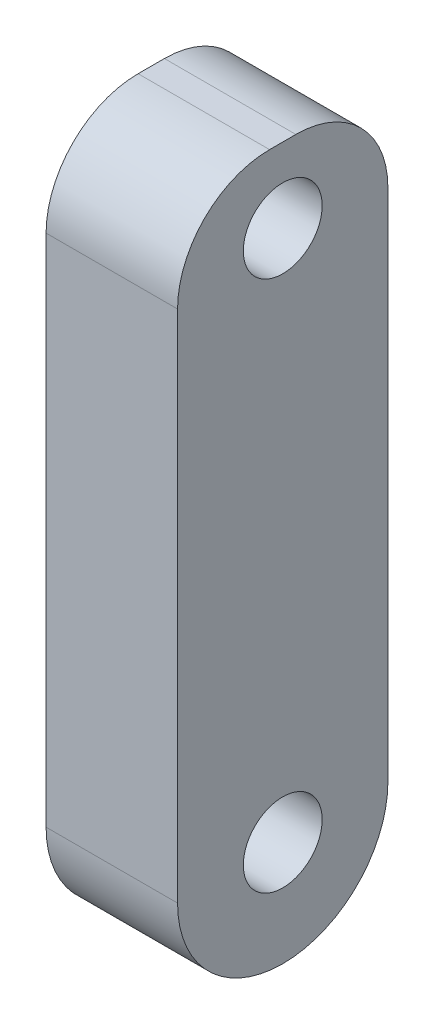
ISO-10303-21;
HEADER;
FILE_DESCRIPTION(('STEP AP214'),'2;1');
FILE_NAME('part.step','',(''),(''),'','','');
FILE_SCHEMA(('AUTOMOTIVE_DESIGN { 1 0 10303 214 1 1 1 1 }'));
ENDSEC;
DATA;
#1=APPLICATION_CONTEXT('core data for automotive mechanical design processes');
#2=APPLICATION_PROTOCOL_DEFINITION('international standard','automotive_design',2000,#1);
#3=PRODUCT_CONTEXT('',#1,'mechanical');
#4=PRODUCT('Part','Part','',(#3));
#5=PRODUCT_RELATED_PRODUCT_CATEGORY('part','',(#4));
#6=PRODUCT_DEFINITION_FORMATION('','',#4);
#7=PRODUCT_DEFINITION_CONTEXT('part definition',#1,'design');
#8=PRODUCT_DEFINITION('design','',#6,#7);
#9=PRODUCT_DEFINITION_SHAPE('','',#8);
#10=(LENGTH_UNIT() NAMED_UNIT(*) SI_UNIT(.MILLI.,.METRE.));
#11=(NAMED_UNIT(*) PLANE_ANGLE_UNIT() SI_UNIT($,.RADIAN.));
#12=(NAMED_UNIT(*) SI_UNIT($,.STERADIAN.) SOLID_ANGLE_UNIT());
#13=UNCERTAINTY_MEASURE_WITH_UNIT(LENGTH_MEASURE(1.E-05),#10,'distance_accuracy_value','');
#14=(GEOMETRIC_REPRESENTATION_CONTEXT(3) GLOBAL_UNCERTAINTY_ASSIGNED_CONTEXT((#13)) GLOBAL_UNIT_ASSIGNED_CONTEXT((#10,
#11,#12)) REPRESENTATION_CONTEXT('',''));
#15=CARTESIAN_POINT('',(0.,0.,0.));
#16=DIRECTION('',(0.,0.,1.));
#17=DIRECTION('',(1.,0.,0.));
#18=AXIS2_PLACEMENT_3D('',#15,#16,#17);
#19=CARTESIAN_POINT('',(5.,9.82612854572492,-48.162641246448));
#20=DIRECTION('',(-1.,0.,0.));
#21=DIRECTION('',(0.,0.,1.));
#22=AXIS2_PLACEMENT_3D('',#19,#20,#21);
#23=CYLINDRICAL_SURFACE('',#22,4.00000000000001);
#24=CARTESIAN_POINT('',(0.,9.82612854572492,-48.162641246448));
#25=DIRECTION('',(1.,0.,0.));
#26=DIRECTION('',(0.,0.,-1.));
#27=AXIS2_PLACEMENT_3D('',#24,#25,#26);
#28=CIRCLE('',#27,4.00000000000001);
#29=CARTESIAN_POINT('',(0.,9.82612854572492,-44.1626412464479));
#30=VERTEX_POINT('',#29);
#31=CARTESIAN_POINT('',(0.,9.82612854572492,-52.162641246448));
#32=VERTEX_POINT('',#31);
#33=EDGE_CURVE('E138',#30,#32,#28,.T.);
#34=ORIENTED_EDGE('',*,*,#33,.T.);
#35=DIRECTION('',(-1.,0.,0.));
#36=VECTOR('',#35,1.);
#37=CARTESIAN_POINT('',(5.,9.82612854572492,-52.162641246448));
#38=LINE('',#37,#36);
#39=CARTESIAN_POINT('',(5.,9.82612854572492,-52.162641246448));
#40=VERTEX_POINT('',#39);
#41=EDGE_CURVE('E11',#40,#32,#38,.T.);
#42=ORIENTED_EDGE('',*,*,#41,.F.);
#43=CARTESIAN_POINT('',(5.,9.82612854572492,-48.162641246448));
#44=DIRECTION('',(1.,0.,0.));
#45=DIRECTION('',(0.,0.,-1.));
#46=AXIS2_PLACEMENT_3D('',#43,#44,#45);
#47=CIRCLE('',#46,4.00000000000001);
#48=CARTESIAN_POINT('',(5.,9.82612854572492,-44.1626412464479));
#49=VERTEX_POINT('',#48);
#50=EDGE_CURVE('E90',#49,#40,#47,.T.);
#51=ORIENTED_EDGE('',*,*,#50,.F.);
#52=DIRECTION('',(-1.,0.,0.));
#53=VECTOR('',#52,1.);
#54=CARTESIAN_POINT('',(5.,9.82612854572492,-44.1626412464479));
#55=LINE('',#54,#53);
#56=EDGE_CURVE('E59',#49,#30,#55,.T.);
#57=ORIENTED_EDGE('',*,*,#56,.T.);
#58=EDGE_LOOP('',(#34,#42,#51,#57));
#59=FACE_BOUND('',#58,.T.);
#60=ADVANCED_FACE('F41',(#59),#23,.T.);
#61=CARTESIAN_POINT('',(5.,0.,-52.162641246448));
#62=DIRECTION('',(0.,0.,-1.));
#63=DIRECTION('',(-1.,0.,0.));
#64=AXIS2_PLACEMENT_3D('',#61,#62,#63);
#65=PLANE('',#64);
#66=DIRECTION('',(0.,-1.,0.));
#67=VECTOR('',#66,1.);
#68=CARTESIAN_POINT('',(0.,0.,-52.162641246448));
#69=LINE('',#68,#67);
#70=CARTESIAN_POINT('',(0.,29.3920683717327,-52.162641246448));
#71=VERTEX_POINT('',#70);
#72=EDGE_CURVE('E141',#71,#32,#69,.T.);
#73=ORIENTED_EDGE('',*,*,#72,.F.);
#74=DIRECTION('',(-1.,0.,0.));
#75=VECTOR('',#74,1.);
#76=CARTESIAN_POINT('',(5.,29.3920683717327,-52.162641246448));
#77=LINE('',#76,#75);
#78=CARTESIAN_POINT('',(5.,29.3920683717327,-52.162641246448));
#79=VERTEX_POINT('',#78);
#80=EDGE_CURVE('E51',#79,#71,#77,.T.);
#81=ORIENTED_EDGE('',*,*,#80,.F.);
#82=DIRECTION('',(0.,-1.,0.));
#83=VECTOR('',#82,1.);
#84=CARTESIAN_POINT('',(5.,0.,-52.162641246448));
#85=LINE('',#84,#83);
#86=EDGE_CURVE('E179',#79,#40,#85,.T.);
#87=ORIENTED_EDGE('',*,*,#86,.T.);
#88=ORIENTED_EDGE('',*,*,#41,.T.);
#89=EDGE_LOOP('',(#73,#81,#87,#88));
#90=FACE_BOUND('',#89,.T.);
#91=ADVANCED_FACE('F178',(#90),#65,.T.);
#92=CARTESIAN_POINT('',(5.,29.3920683717327,-48.662641246448));
#93=DIRECTION('',(-1.,0.,0.));
#94=DIRECTION('',(0.,0.,1.));
#95=AXIS2_PLACEMENT_3D('',#92,#93,#94);
#96=CYLINDRICAL_SURFACE('',#95,3.5);
#97=CARTESIAN_POINT('',(0.,29.3920683717327,-48.662641246448));
#98=DIRECTION('',(1.,0.,0.));
#99=DIRECTION('',(0.,0.,-1.));
#100=AXIS2_PLACEMENT_3D('',#97,#98,#99);
#101=CIRCLE('',#100,3.5);
#102=CARTESIAN_POINT('',(0.,32.8920683717327,-48.6626412464479));
#103=VERTEX_POINT('',#102);
#104=EDGE_CURVE('E145',#71,#103,#101,.T.);
#105=ORIENTED_EDGE('',*,*,#104,.T.);
#106=DIRECTION('',(-1.,0.,0.));
#107=VECTOR('',#106,1.);
#108=CARTESIAN_POINT('',(5.,32.8920683717327,-48.6626412464479));
#109=LINE('',#108,#107);
#110=CARTESIAN_POINT('',(5.,32.8920683717327,-48.6626412464479));
#111=VERTEX_POINT('',#110);
#112=EDGE_CURVE('E111',#111,#103,#109,.T.);
#113=ORIENTED_EDGE('',*,*,#112,.F.);
#114=CARTESIAN_POINT('',(5.,29.3920683717327,-48.662641246448));
#115=DIRECTION('',(1.,0.,0.));
#116=DIRECTION('',(0.,0.,-1.));
#117=AXIS2_PLACEMENT_3D('',#114,#115,#116);
#118=CIRCLE('',#117,3.5);
#119=EDGE_CURVE('E118',#79,#111,#118,.T.);
#120=ORIENTED_EDGE('',*,*,#119,.F.);
#121=ORIENTED_EDGE('',*,*,#80,.T.);
#122=EDGE_LOOP('',(#105,#113,#120,#121));
#123=FACE_BOUND('',#122,.T.);
#124=ADVANCED_FACE('F171',(#123),#96,.T.);
#125=CARTESIAN_POINT('',(5.,32.8920683717327,0.));
#126=DIRECTION('',(0.,1.,0.));
#127=DIRECTION('',(0.,0.,1.));
#128=AXIS2_PLACEMENT_3D('',#125,#126,#127);
#129=PLANE('',#128);
#130=DIRECTION('',(0.,0.,-1.));
#131=VECTOR('',#130,1.);
#132=CARTESIAN_POINT('',(0.,32.8920683717327,0.));
#133=LINE('',#132,#131);
#134=CARTESIAN_POINT('',(0.,32.8920683717327,-47.662641246448));
#135=VERTEX_POINT('',#134);
#136=EDGE_CURVE('E106',#135,#103,#133,.T.);
#137=ORIENTED_EDGE('',*,*,#136,.F.);
#138=DIRECTION('',(-1.,0.,0.));
#139=VECTOR('',#138,1.);
#140=CARTESIAN_POINT('',(5.,32.8920683717327,-47.662641246448));
#141=LINE('',#140,#139);
#142=CARTESIAN_POINT('',(5.,32.8920683717327,-47.662641246448));
#143=VERTEX_POINT('',#142);
#144=EDGE_CURVE('E101',#143,#135,#141,.T.);
#145=ORIENTED_EDGE('',*,*,#144,.F.);
#146=DIRECTION('',(0.,0.,-1.));
#147=VECTOR('',#146,1.);
#148=CARTESIAN_POINT('',(5.,32.8920683717327,0.));
#149=LINE('',#148,#147);
#150=EDGE_CURVE('E104',#143,#111,#149,.T.);
#151=ORIENTED_EDGE('',*,*,#150,.T.);
#152=ORIENTED_EDGE('',*,*,#112,.T.);
#153=EDGE_LOOP('',(#137,#145,#151,#152));
#154=FACE_BOUND('',#153,.T.);
#155=ADVANCED_FACE('F103',(#154),#129,.T.);
#156=CARTESIAN_POINT('',(5.,29.3920683717327,-47.662641246448));
#157=DIRECTION('',(-1.,0.,0.));
#158=DIRECTION('',(0.,0.,1.));
#159=AXIS2_PLACEMENT_3D('',#156,#157,#158);
#160=CYLINDRICAL_SURFACE('',#159,3.5);
#161=CARTESIAN_POINT('',(0.,29.3920683717327,-47.662641246448));
#162=DIRECTION('',(1.,0.,0.));
#163=DIRECTION('',(0.,0.,-1.));
#164=AXIS2_PLACEMENT_3D('',#161,#162,#163);
#165=CIRCLE('',#164,3.5);
#166=CARTESIAN_POINT('',(0.,29.3920683717327,-44.1626412464479));
#167=VERTEX_POINT('',#166);
#168=EDGE_CURVE('E151',#167,#135,#165,.F.);
#169=ORIENTED_EDGE('',*,*,#168,.F.);
#170=DIRECTION('',(-1.,0.,0.));
#171=VECTOR('',#170,1.);
#172=CARTESIAN_POINT('',(5.,29.3920683717327,-44.1626412464479));
#173=LINE('',#172,#171);
#174=CARTESIAN_POINT('',(5.,29.3920683717327,-44.1626412464479));
#175=VERTEX_POINT('',#174);
#176=EDGE_CURVE('E78',#175,#167,#173,.T.);
#177=ORIENTED_EDGE('',*,*,#176,.F.);
#178=CARTESIAN_POINT('',(5.,29.3920683717327,-47.662641246448));
#179=DIRECTION('',(1.,0.,0.));
#180=DIRECTION('',(0.,0.,-1.));
#181=AXIS2_PLACEMENT_3D('',#178,#179,#180);
#182=CIRCLE('',#181,3.5);
#183=EDGE_CURVE('E116',#175,#143,#182,.F.);
#184=ORIENTED_EDGE('',*,*,#183,.T.);
#185=ORIENTED_EDGE('',*,*,#144,.T.);
#186=EDGE_LOOP('',(#169,#177,#184,#185));
#187=FACE_BOUND('',#186,.T.);
#188=ADVANCED_FACE('F122',(#187),#160,.T.);
#189=CARTESIAN_POINT('',(5.,0.,-44.1626412464479));
#190=DIRECTION('',(0.,0.,1.));
#191=DIRECTION('',(1.,0.,0.));
#192=AXIS2_PLACEMENT_3D('',#189,#190,#191);
#193=PLANE('',#192);
#194=DIRECTION('',(0.,1.,0.));
#195=VECTOR('',#194,1.);
#196=CARTESIAN_POINT('',(0.,0.,-44.1626412464479));
#197=LINE('',#196,#195);
#198=EDGE_CURVE('E154',#30,#167,#197,.T.);
#199=ORIENTED_EDGE('',*,*,#198,.F.);
#200=ORIENTED_EDGE('',*,*,#56,.F.);
#201=DIRECTION('',(0.,1.,0.));
#202=VECTOR('',#201,1.);
#203=CARTESIAN_POINT('',(5.,0.,-44.1626412464479));
#204=LINE('',#203,#202);
#205=EDGE_CURVE('E124',#49,#175,#204,.T.);
#206=ORIENTED_EDGE('',*,*,#205,.T.);
#207=ORIENTED_EDGE('',*,*,#176,.T.);
#208=EDGE_LOOP('',(#199,#200,#206,#207));
#209=FACE_BOUND('',#208,.T.);
#210=ADVANCED_FACE('F180',(#209),#193,.T.);
#211=CARTESIAN_POINT('',(5.,9.82612854572492,-48.162641246448));
#212=DIRECTION('',(-1.,0.,0.));
#213=DIRECTION('',(0.,0.,1.));
#214=AXIS2_PLACEMENT_3D('',#211,#212,#213);
#215=CYLINDRICAL_SURFACE('',#214,1.5);
#216=CARTESIAN_POINT('',(5.,9.82612854572492,-48.162641246448));
#217=DIRECTION('',(1.,0.,0.));
#218=DIRECTION('',(0.,0.,-1.));
#219=AXIS2_PLACEMENT_3D('',#216,#217,#218);
#220=CIRCLE('',#219,1.5);
#221=CARTESIAN_POINT('',(5.,9.82612854572492,-49.662641246448));
#222=VERTEX_POINT('',#221);
#223=EDGE_CURVE('E162',#222,#222,#220,.T.);
#224=ORIENTED_EDGE('',*,*,#223,.T.);
#225=EDGE_LOOP('',(#224));
#226=FACE_BOUND('',#225,.T.);
#227=CARTESIAN_POINT('',(0.,9.82612854572492,-48.162641246448));
#228=DIRECTION('',(1.,0.,0.));
#229=DIRECTION('',(0.,0.,-1.));
#230=AXIS2_PLACEMENT_3D('',#227,#228,#229);
#231=CIRCLE('',#230,1.5);
#232=CARTESIAN_POINT('',(0.,9.82612854572492,-49.662641246448));
#233=VERTEX_POINT('',#232);
#234=EDGE_CURVE('E134',#233,#233,#231,.T.);
#235=ORIENTED_EDGE('',*,*,#234,.F.);
#236=EDGE_LOOP('',(#235));
#237=FACE_BOUND('',#236,.T.);
#238=ADVANCED_FACE('F43',(#226,#237),#215,.F.);
#239=CARTESIAN_POINT('',(5.,30.0515396336348,-48.162641246448));
#240=DIRECTION('',(-1.,0.,0.));
#241=DIRECTION('',(0.,0.,1.));
#242=AXIS2_PLACEMENT_3D('',#239,#240,#241);
#243=CYLINDRICAL_SURFACE('',#242,1.5);
#244=CARTESIAN_POINT('',(5.,30.0515396336348,-48.162641246448));
#245=DIRECTION('',(1.,0.,0.));
#246=DIRECTION('',(0.,0.,-1.));
#247=AXIS2_PLACEMENT_3D('',#244,#245,#246);
#248=CIRCLE('',#247,1.5);
#249=CARTESIAN_POINT('',(5.,30.0515396336348,-49.662641246448));
#250=VERTEX_POINT('',#249);
#251=EDGE_CURVE('E127',#250,#250,#248,.T.);
#252=ORIENTED_EDGE('',*,*,#251,.T.);
#253=EDGE_LOOP('',(#252));
#254=FACE_BOUND('',#253,.T.);
#255=CARTESIAN_POINT('',(0.,30.0515396336348,-48.162641246448));
#256=DIRECTION('',(1.,0.,0.));
#257=DIRECTION('',(0.,0.,-1.));
#258=AXIS2_PLACEMENT_3D('',#255,#256,#257);
#259=CIRCLE('',#258,1.5);
#260=CARTESIAN_POINT('',(0.,30.0515396336348,-49.662641246448));
#261=VERTEX_POINT('',#260);
#262=EDGE_CURVE('E158',#261,#261,#259,.T.);
#263=ORIENTED_EDGE('',*,*,#262,.F.);
#264=EDGE_LOOP('',(#263));
#265=FACE_BOUND('',#264,.T.);
#266=ADVANCED_FACE('F187',(#254,#265),#243,.F.);
#267=CARTESIAN_POINT('',(5.,0.,0.));
#268=DIRECTION('',(1.,0.,0.));
#269=DIRECTION('',(0.,0.,-1.));
#270=AXIS2_PLACEMENT_3D('',#267,#268,#269);
#271=PLANE('',#270);
#272=ORIENTED_EDGE('',*,*,#223,.F.);
#273=EDGE_LOOP('',(#272));
#274=FACE_BOUND('',#273,.T.);
#275=ORIENTED_EDGE('',*,*,#50,.T.);
#276=ORIENTED_EDGE('',*,*,#86,.F.);
#277=ORIENTED_EDGE('',*,*,#119,.T.);
#278=ORIENTED_EDGE('',*,*,#150,.F.);
#279=ORIENTED_EDGE('',*,*,#183,.F.);
#280=ORIENTED_EDGE('',*,*,#205,.F.);
#281=EDGE_LOOP('',(#275,#276,#277,#278,#279,#280));
#282=FACE_BOUND('',#281,.T.);
#283=ORIENTED_EDGE('',*,*,#251,.F.);
#284=EDGE_LOOP('',(#283));
#285=FACE_BOUND('',#284,.T.);
#286=ADVANCED_FACE('F114',(#274,#282,#285),#271,.T.);
#287=CARTESIAN_POINT('',(0.,0.,0.));
#288=DIRECTION('',(1.,0.,0.));
#289=DIRECTION('',(0.,0.,-1.));
#290=AXIS2_PLACEMENT_3D('',#287,#288,#289);
#291=PLANE('',#290);
#292=ORIENTED_EDGE('',*,*,#234,.T.);
#293=EDGE_LOOP('',(#292));
#294=FACE_BOUND('',#293,.T.);
#295=ORIENTED_EDGE('',*,*,#33,.F.);
#296=ORIENTED_EDGE('',*,*,#198,.T.);
#297=ORIENTED_EDGE('',*,*,#168,.T.);
#298=ORIENTED_EDGE('',*,*,#136,.T.);
#299=ORIENTED_EDGE('',*,*,#104,.F.);
#300=ORIENTED_EDGE('',*,*,#72,.T.);
#301=EDGE_LOOP('',(#295,#296,#297,#298,#299,#300));
#302=FACE_BOUND('',#301,.T.);
#303=ORIENTED_EDGE('',*,*,#262,.T.);
#304=EDGE_LOOP('',(#303));
#305=FACE_BOUND('',#304,.T.);
#306=ADVANCED_FACE('F176',(#294,#302,#305),#291,.F.);
#307=CLOSED_SHELL('',(#60,#91,#124,#155,#188,#210,#238,#266,#286,#306));
#308=MANIFOLD_SOLID_BREP('B2',#307);
#309=ADVANCED_BREP_SHAPE_REPRESENTATION('',(#18,#308),#14);
#310=SHAPE_DEFINITION_REPRESENTATION(#9,#309);
ENDSEC;
END-ISO-10303-21;
